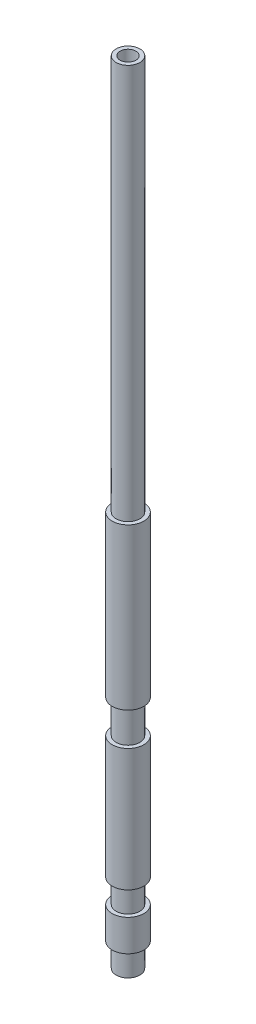
ISO-10303-21;
HEADER;
FILE_DESCRIPTION(('STEP AP214'),'2;1');
FILE_NAME('part.step','',(''),(''),'','','');
FILE_SCHEMA(('AUTOMOTIVE_DESIGN { 1 0 10303 214 1 1 1 1 }'));
ENDSEC;
DATA;
#1=APPLICATION_CONTEXT('core data for automotive mechanical design processes');
#2=APPLICATION_PROTOCOL_DEFINITION('international standard','automotive_design',2000,#1);
#3=PRODUCT_CONTEXT('',#1,'mechanical');
#4=PRODUCT('Part','Part','',(#3));
#5=PRODUCT_RELATED_PRODUCT_CATEGORY('part','',(#4));
#6=PRODUCT_DEFINITION_FORMATION('','',#4);
#7=PRODUCT_DEFINITION_CONTEXT('part definition',#1,'design');
#8=PRODUCT_DEFINITION('design','',#6,#7);
#9=PRODUCT_DEFINITION_SHAPE('','',#8);
#10=(LENGTH_UNIT() NAMED_UNIT(*) SI_UNIT(.MILLI.,.METRE.));
#11=(NAMED_UNIT(*) PLANE_ANGLE_UNIT() SI_UNIT($,.RADIAN.));
#12=(NAMED_UNIT(*) SI_UNIT($,.STERADIAN.) SOLID_ANGLE_UNIT());
#13=UNCERTAINTY_MEASURE_WITH_UNIT(LENGTH_MEASURE(1.E-05),#10,'distance_accuracy_value','');
#14=(GEOMETRIC_REPRESENTATION_CONTEXT(3) GLOBAL_UNCERTAINTY_ASSIGNED_CONTEXT((#13)) GLOBAL_UNIT_ASSIGNED_CONTEXT((#10,
#11,#12)) REPRESENTATION_CONTEXT('',''));
#15=CARTESIAN_POINT('',(0.,0.,0.));
#16=DIRECTION('',(0.,0.,1.));
#17=DIRECTION('',(1.,0.,0.));
#18=AXIS2_PLACEMENT_3D('',#15,#16,#17);
#19=CARTESIAN_POINT('',(0.,100.,0.));
#20=DIRECTION('',(0.,-1.,0.));
#21=DIRECTION('',(0.,0.,-1.));
#22=AXIS2_PLACEMENT_3D('',#19,#20,#21);
#23=CYLINDRICAL_SURFACE('',#22,2.);
#24=CARTESIAN_POINT('',(0.,29.7,0.));
#25=DIRECTION('',(0.,-1.,0.));
#26=DIRECTION('',(0.,0.,-1.));
#27=AXIS2_PLACEMENT_3D('',#24,#25,#26);
#28=CIRCLE('',#27,2.);
#29=CARTESIAN_POINT('',(0.,29.7,-2.));
#30=VERTEX_POINT('',#29);
#31=EDGE_CURVE('E76',#30,#30,#28,.T.);
#32=ORIENTED_EDGE('',*,*,#31,.F.);
#33=EDGE_LOOP('',(#32));
#34=FACE_BOUND('',#33,.T.);
#35=CARTESIAN_POINT('',(0.,50.,0.));
#36=DIRECTION('',(0.,-1.,0.));
#37=DIRECTION('',(0.,0.,-1.));
#38=AXIS2_PLACEMENT_3D('',#35,#36,#37);
#39=CIRCLE('',#38,2.00000000000001);
#40=CARTESIAN_POINT('',(0.,50.,-2.00000000000001));
#41=VERTEX_POINT('',#40);
#42=EDGE_CURVE('E67',#41,#41,#39,.T.);
#43=ORIENTED_EDGE('',*,*,#42,.T.);
#44=EDGE_LOOP('',(#43));
#45=FACE_BOUND('',#44,.T.);
#46=ADVANCED_FACE('F34',(#34,#45),#23,.T.);
#47=CARTESIAN_POINT('',(0.,100.,0.));
#48=DIRECTION('',(0.,1.,0.));
#49=DIRECTION('',(0.,0.,1.));
#50=AXIS2_PLACEMENT_3D('',#47,#48,#49);
#51=PLANE('',#50);
#52=CARTESIAN_POINT('',(0.,100.,0.));
#53=DIRECTION('',(0.,1.,0.));
#54=DIRECTION('',(0.,0.,1.));
#55=AXIS2_PLACEMENT_3D('',#52,#53,#54);
#56=CIRCLE('',#55,1.);
#57=CARTESIAN_POINT('',(0.,100.,1.));
#58=VERTEX_POINT('',#57);
#59=EDGE_CURVE('E10',#58,#58,#56,.T.);
#60=ORIENTED_EDGE('',*,*,#59,.F.);
#61=EDGE_LOOP('',(#60));
#62=FACE_BOUND('',#61,.T.);
#63=CARTESIAN_POINT('',(0.,100.,0.));
#64=DIRECTION('',(0.,-1.,0.));
#65=DIRECTION('',(0.,0.,-1.));
#66=AXIS2_PLACEMENT_3D('',#63,#64,#65);
#67=CIRCLE('',#66,1.49999999999998);
#68=CARTESIAN_POINT('',(0.,100.,-1.49999999999998));
#69=VERTEX_POINT('',#68);
#70=EDGE_CURVE('E73',#69,#69,#67,.T.);
#71=ORIENTED_EDGE('',*,*,#70,.F.);
#72=EDGE_LOOP('',(#71));
#73=FACE_BOUND('',#72,.T.);
#74=ADVANCED_FACE('F112',(#62,#73),#51,.T.);
#75=CARTESIAN_POINT('',(0.,7.,0.));
#76=DIRECTION('',(0.,-1.,0.));
#77=DIRECTION('',(0.,0.,-1.));
#78=AXIS2_PLACEMENT_3D('',#75,#76,#77);
#79=CIRCLE('',#78,2.);
#80=CARTESIAN_POINT('',(0.,7.,-2.));
#81=VERTEX_POINT('',#80);
#82=EDGE_CURVE('E64',#81,#81,#79,.T.);
#83=ORIENTED_EDGE('',*,*,#82,.T.);
#84=EDGE_LOOP('',(#83));
#85=FACE_BOUND('',#84,.T.);
#86=CARTESIAN_POINT('',(0.,3.,0.));
#87=DIRECTION('',(0.,-1.,0.));
#88=DIRECTION('',(0.,0.,-1.));
#89=AXIS2_PLACEMENT_3D('',#86,#87,#88);
#90=CIRCLE('',#89,2.);
#91=CARTESIAN_POINT('',(0.,3.,-2.));
#92=VERTEX_POINT('',#91);
#93=EDGE_CURVE('E45',#92,#92,#90,.T.);
#94=ORIENTED_EDGE('',*,*,#93,.F.);
#95=EDGE_LOOP('',(#94));
#96=FACE_BOUND('',#95,.T.);
#97=ADVANCED_FACE('F113',(#85,#96),#23,.T.);
#98=CARTESIAN_POINT('',(0.,0.,0.));
#99=DIRECTION('',(0.,1.,0.));
#100=DIRECTION('',(0.,0.,1.));
#101=AXIS2_PLACEMENT_3D('',#98,#99,#100);
#102=PLANE('',#101);
#103=CARTESIAN_POINT('',(0.,0.,0.));
#104=DIRECTION('',(0.,1.,0.));
#105=DIRECTION('',(0.,0.,1.));
#106=AXIS2_PLACEMENT_3D('',#103,#104,#105);
#107=CIRCLE('',#106,1.);
#108=CARTESIAN_POINT('',(0.,0.,1.));
#109=VERTEX_POINT('',#108);
#110=EDGE_CURVE('E38',#109,#109,#107,.T.);
#111=ORIENTED_EDGE('',*,*,#110,.T.);
#112=EDGE_LOOP('',(#111));
#113=FACE_BOUND('',#112,.T.);
#114=CARTESIAN_POINT('',(0.,0.,0.));
#115=DIRECTION('',(0.,-1.,0.));
#116=DIRECTION('',(0.,0.,-1.));
#117=AXIS2_PLACEMENT_3D('',#114,#115,#116);
#118=CIRCLE('',#117,1.5);
#119=CARTESIAN_POINT('',(0.,0.,-1.5));
#120=VERTEX_POINT('',#119);
#121=EDGE_CURVE('E52',#120,#120,#118,.T.);
#122=ORIENTED_EDGE('',*,*,#121,.T.);
#123=EDGE_LOOP('',(#122));
#124=FACE_BOUND('',#123,.T.);
#125=ADVANCED_FACE('F136',(#113,#124),#102,.F.);
#126=CARTESIAN_POINT('',(0.,25.5,0.));
#127=DIRECTION('',(0.,-1.,0.));
#128=DIRECTION('',(0.,0.,-1.));
#129=AXIS2_PLACEMENT_3D('',#126,#127,#128);
#130=CIRCLE('',#129,2.);
#131=CARTESIAN_POINT('',(0.,25.5,-2.));
#132=VERTEX_POINT('',#131);
#133=EDGE_CURVE('E85',#132,#132,#130,.T.);
#134=ORIENTED_EDGE('',*,*,#133,.T.);
#135=EDGE_LOOP('',(#134));
#136=FACE_BOUND('',#135,.T.);
#137=CARTESIAN_POINT('',(0.,10.,0.));
#138=DIRECTION('',(0.,-1.,0.));
#139=DIRECTION('',(0.,0.,-1.));
#140=AXIS2_PLACEMENT_3D('',#137,#138,#139);
#141=CIRCLE('',#140,2.);
#142=CARTESIAN_POINT('',(0.,10.,-2.));
#143=VERTEX_POINT('',#142);
#144=EDGE_CURVE('E61',#143,#143,#141,.T.);
#145=ORIENTED_EDGE('',*,*,#144,.F.);
#146=EDGE_LOOP('',(#145));
#147=FACE_BOUND('',#146,.T.);
#148=ADVANCED_FACE('F36',(#136,#147),#23,.T.);
#149=CARTESIAN_POINT('',(0.,100.,0.));
#150=DIRECTION('',(0.,-1.,0.));
#151=DIRECTION('',(0.,0.,-1.));
#152=AXIS2_PLACEMENT_3D('',#149,#150,#151);
#153=CYLINDRICAL_SURFACE('',#152,1.);
#154=ORIENTED_EDGE('',*,*,#59,.T.);
#155=EDGE_LOOP('',(#154));
#156=FACE_BOUND('',#155,.T.);
#157=ORIENTED_EDGE('',*,*,#110,.F.);
#158=EDGE_LOOP('',(#157));
#159=FACE_BOUND('',#158,.T.);
#160=ADVANCED_FACE('F139',(#156,#159),#153,.F.);
#161=CARTESIAN_POINT('',(2.,3.,0.));
#162=DIRECTION('',(0.,1.,0.));
#163=DIRECTION('',(0.,0.,1.));
#164=AXIS2_PLACEMENT_3D('',#161,#162,#163);
#165=PLANE('',#164);
#166=CARTESIAN_POINT('',(0.,3.,0.));
#167=DIRECTION('',(0.,-1.,0.));
#168=DIRECTION('',(0.,0.,-1.));
#169=AXIS2_PLACEMENT_3D('',#166,#167,#168);
#170=CIRCLE('',#169,1.5);
#171=CARTESIAN_POINT('',(0.,3.,-1.5));
#172=VERTEX_POINT('',#171);
#173=EDGE_CURVE('E49',#172,#172,#170,.T.);
#174=ORIENTED_EDGE('',*,*,#173,.F.);
#175=EDGE_LOOP('',(#174));
#176=FACE_BOUND('',#175,.T.);
#177=ORIENTED_EDGE('',*,*,#93,.T.);
#178=EDGE_LOOP('',(#177));
#179=FACE_BOUND('',#178,.T.);
#180=ADVANCED_FACE('F155',(#176,#179),#165,.F.);
#181=CARTESIAN_POINT('',(0.,0.,0.));
#182=DIRECTION('',(0.,-1.,0.));
#183=DIRECTION('',(0.,0.,-1.));
#184=AXIS2_PLACEMENT_3D('',#181,#182,#183);
#185=CYLINDRICAL_SURFACE('',#184,1.5);
#186=ORIENTED_EDGE('',*,*,#121,.F.);
#187=EDGE_LOOP('',(#186));
#188=FACE_BOUND('',#187,.T.);
#189=ORIENTED_EDGE('',*,*,#173,.T.);
#190=EDGE_LOOP('',(#189));
#191=FACE_BOUND('',#190,.T.);
#192=ADVANCED_FACE('F151',(#188,#191),#185,.T.);
#193=CARTESIAN_POINT('',(2.,7.,0.));
#194=DIRECTION('',(0.,-1.,0.));
#195=DIRECTION('',(0.,0.,-1.));
#196=AXIS2_PLACEMENT_3D('',#193,#194,#195);
#197=PLANE('',#196);
#198=ORIENTED_EDGE('',*,*,#82,.F.);
#199=EDGE_LOOP('',(#198));
#200=FACE_BOUND('',#199,.T.);
#201=CARTESIAN_POINT('',(0.,7.,0.));
#202=DIRECTION('',(0.,-1.,0.));
#203=DIRECTION('',(0.,0.,-1.));
#204=AXIS2_PLACEMENT_3D('',#201,#202,#203);
#205=CIRCLE('',#204,1.5);
#206=CARTESIAN_POINT('',(0.,7.,-1.5));
#207=VERTEX_POINT('',#206);
#208=EDGE_CURVE('E55',#207,#207,#205,.T.);
#209=ORIENTED_EDGE('',*,*,#208,.T.);
#210=EDGE_LOOP('',(#209));
#211=FACE_BOUND('',#210,.T.);
#212=ADVANCED_FACE('F154',(#200,#211),#197,.F.);
#213=CARTESIAN_POINT('',(0.,0.,0.));
#214=DIRECTION('',(0.,-1.,0.));
#215=DIRECTION('',(0.,0.,-1.));
#216=AXIS2_PLACEMENT_3D('',#213,#214,#215);
#217=CYLINDRICAL_SURFACE('',#216,1.5);
#218=ORIENTED_EDGE('',*,*,#208,.F.);
#219=EDGE_LOOP('',(#218));
#220=FACE_BOUND('',#219,.T.);
#221=CARTESIAN_POINT('',(0.,10.,0.));
#222=DIRECTION('',(0.,-1.,0.));
#223=DIRECTION('',(0.,0.,-1.));
#224=AXIS2_PLACEMENT_3D('',#221,#222,#223);
#225=CIRCLE('',#224,1.5);
#226=CARTESIAN_POINT('',(0.,10.,-1.5));
#227=VERTEX_POINT('',#226);
#228=EDGE_CURVE('E58',#227,#227,#225,.T.);
#229=ORIENTED_EDGE('',*,*,#228,.T.);
#230=EDGE_LOOP('',(#229));
#231=FACE_BOUND('',#230,.T.);
#232=ADVANCED_FACE('F169',(#220,#231),#217,.T.);
#233=CARTESIAN_POINT('',(2.,10.,0.));
#234=DIRECTION('',(0.,1.,0.));
#235=DIRECTION('',(0.,0.,1.));
#236=AXIS2_PLACEMENT_3D('',#233,#234,#235);
#237=PLANE('',#236);
#238=ORIENTED_EDGE('',*,*,#228,.F.);
#239=EDGE_LOOP('',(#238));
#240=FACE_BOUND('',#239,.T.);
#241=ORIENTED_EDGE('',*,*,#144,.T.);
#242=EDGE_LOOP('',(#241));
#243=FACE_BOUND('',#242,.T.);
#244=ADVANCED_FACE('F119',(#240,#243),#237,.F.);
#245=CARTESIAN_POINT('',(2.00000000000001,50.,0.));
#246=DIRECTION('',(0.,-1.,0.));
#247=DIRECTION('',(0.,0.,-1.));
#248=AXIS2_PLACEMENT_3D('',#245,#246,#247);
#249=PLANE('',#248);
#250=ORIENTED_EDGE('',*,*,#42,.F.);
#251=EDGE_LOOP('',(#250));
#252=FACE_BOUND('',#251,.T.);
#253=CARTESIAN_POINT('',(0.,50.,0.));
#254=DIRECTION('',(0.,-1.,0.));
#255=DIRECTION('',(0.,0.,-1.));
#256=AXIS2_PLACEMENT_3D('',#253,#254,#255);
#257=CIRCLE('',#256,1.50000000000001);
#258=CARTESIAN_POINT('',(0.,50.,-1.50000000000001));
#259=VERTEX_POINT('',#258);
#260=EDGE_CURVE('E70',#259,#259,#257,.T.);
#261=ORIENTED_EDGE('',*,*,#260,.T.);
#262=EDGE_LOOP('',(#261));
#263=FACE_BOUND('',#262,.T.);
#264=ADVANCED_FACE('F116',(#252,#263),#249,.F.);
#265=CARTESIAN_POINT('',(0.,0.,0.));
#266=DIRECTION('',(0.,-1.,0.));
#267=DIRECTION('',(0.,0.,-1.));
#268=AXIS2_PLACEMENT_3D('',#265,#266,#267);
#269=CYLINDRICAL_SURFACE('',#268,1.49999999999999);
#270=ORIENTED_EDGE('',*,*,#260,.F.);
#271=EDGE_LOOP('',(#270));
#272=FACE_BOUND('',#271,.T.);
#273=ORIENTED_EDGE('',*,*,#70,.T.);
#274=EDGE_LOOP('',(#273));
#275=FACE_BOUND('',#274,.T.);
#276=ADVANCED_FACE('F106',(#272,#275),#269,.T.);
#277=CARTESIAN_POINT('',(2.,29.7,0.));
#278=DIRECTION('',(0.,1.,0.));
#279=DIRECTION('',(0.,0.,1.));
#280=AXIS2_PLACEMENT_3D('',#277,#278,#279);
#281=PLANE('',#280);
#282=CARTESIAN_POINT('',(0.,29.7,0.));
#283=DIRECTION('',(0.,-1.,0.));
#284=DIRECTION('',(0.,0.,-1.));
#285=AXIS2_PLACEMENT_3D('',#282,#283,#284);
#286=CIRCLE('',#285,1.5);
#287=CARTESIAN_POINT('',(0.,29.7,-1.5));
#288=VERTEX_POINT('',#287);
#289=EDGE_CURVE('E79',#288,#288,#286,.T.);
#290=ORIENTED_EDGE('',*,*,#289,.F.);
#291=EDGE_LOOP('',(#290));
#292=FACE_BOUND('',#291,.T.);
#293=ORIENTED_EDGE('',*,*,#31,.T.);
#294=EDGE_LOOP('',(#293));
#295=FACE_BOUND('',#294,.T.);
#296=ADVANCED_FACE('F100',(#292,#295),#281,.F.);
#297=CARTESIAN_POINT('',(0.,0.,0.));
#298=DIRECTION('',(0.,-1.,0.));
#299=DIRECTION('',(0.,0.,-1.));
#300=AXIS2_PLACEMENT_3D('',#297,#298,#299);
#301=CYLINDRICAL_SURFACE('',#300,1.5);
#302=CARTESIAN_POINT('',(0.,25.5,0.));
#303=DIRECTION('',(0.,-1.,0.));
#304=DIRECTION('',(0.,0.,-1.));
#305=AXIS2_PLACEMENT_3D('',#302,#303,#304);
#306=CIRCLE('',#305,1.5);
#307=CARTESIAN_POINT('',(0.,25.5,-1.5));
#308=VERTEX_POINT('',#307);
#309=EDGE_CURVE('E82',#308,#308,#306,.T.);
#310=ORIENTED_EDGE('',*,*,#309,.F.);
#311=EDGE_LOOP('',(#310));
#312=FACE_BOUND('',#311,.T.);
#313=ORIENTED_EDGE('',*,*,#289,.T.);
#314=EDGE_LOOP('',(#313));
#315=FACE_BOUND('',#314,.T.);
#316=ADVANCED_FACE('F94',(#312,#315),#301,.T.);
#317=CARTESIAN_POINT('',(2.,25.5,0.));
#318=DIRECTION('',(0.,-1.,0.));
#319=DIRECTION('',(0.,0.,-1.));
#320=AXIS2_PLACEMENT_3D('',#317,#318,#319);
#321=PLANE('',#320);
#322=ORIENTED_EDGE('',*,*,#133,.F.);
#323=EDGE_LOOP('',(#322));
#324=FACE_BOUND('',#323,.T.);
#325=ORIENTED_EDGE('',*,*,#309,.T.);
#326=EDGE_LOOP('',(#325));
#327=FACE_BOUND('',#326,.T.);
#328=ADVANCED_FACE('F91',(#324,#327),#321,.F.);
#329=CLOSED_SHELL('',(#46,#74,#97,#125,#148,#160,#180,#192,#212,#232,#244,#264,#276,#296,#316,#328));
#330=MANIFOLD_SOLID_BREP('B2',#329);
#331=ADVANCED_BREP_SHAPE_REPRESENTATION('',(#18,#330),#14);
#332=SHAPE_DEFINITION_REPRESENTATION(#9,#331);
ENDSEC;
END-ISO-10303-21;
